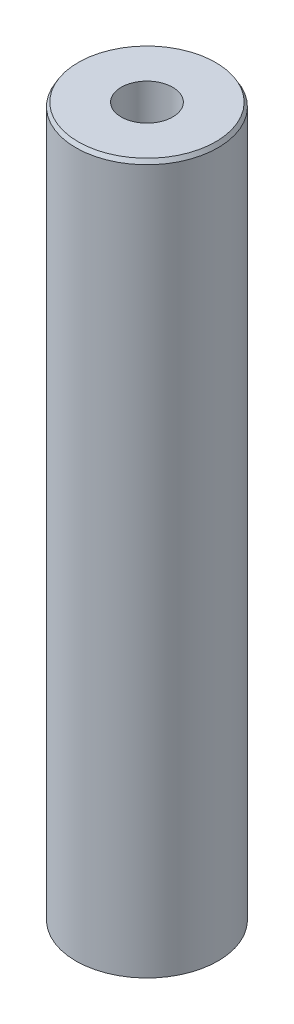
ISO-10303-21;
HEADER;
FILE_DESCRIPTION(('STEP AP214'),'2;1');
FILE_NAME('part.step','',(''),(''),'','','');
FILE_SCHEMA(('AUTOMOTIVE_DESIGN { 1 0 10303 214 1 1 1 1 }'));
ENDSEC;
DATA;
#1=APPLICATION_CONTEXT('core data for automotive mechanical design processes');
#2=APPLICATION_PROTOCOL_DEFINITION('international standard','automotive_design',2000,#1);
#3=PRODUCT_CONTEXT('',#1,'mechanical');
#4=PRODUCT('Part','Part','',(#3));
#5=PRODUCT_RELATED_PRODUCT_CATEGORY('part','',(#4));
#6=PRODUCT_DEFINITION_FORMATION('','',#4);
#7=PRODUCT_DEFINITION_CONTEXT('part definition',#1,'design');
#8=PRODUCT_DEFINITION('design','',#6,#7);
#9=PRODUCT_DEFINITION_SHAPE('','',#8);
#10=(LENGTH_UNIT() NAMED_UNIT(*) SI_UNIT(.MILLI.,.METRE.));
#11=(NAMED_UNIT(*) PLANE_ANGLE_UNIT() SI_UNIT($,.RADIAN.));
#12=(NAMED_UNIT(*) SI_UNIT($,.STERADIAN.) SOLID_ANGLE_UNIT());
#13=UNCERTAINTY_MEASURE_WITH_UNIT(LENGTH_MEASURE(1.E-05),#10,'distance_accuracy_value','');
#14=(GEOMETRIC_REPRESENTATION_CONTEXT(3) GLOBAL_UNCERTAINTY_ASSIGNED_CONTEXT((#13)) GLOBAL_UNIT_ASSIGNED_CONTEXT((#10,
#11,#12)) REPRESENTATION_CONTEXT('',''));
#15=CARTESIAN_POINT('',(0.,0.,0.));
#16=DIRECTION('',(0.,0.,1.));
#17=DIRECTION('',(1.,0.,0.));
#18=AXIS2_PLACEMENT_3D('',#15,#16,#17);
#19=CARTESIAN_POINT('',(0.,600.,0.));
#20=DIRECTION('',(0.,-1.,0.));
#21=DIRECTION('',(0.,0.,-1.));
#22=AXIS2_PLACEMENT_3D('',#19,#20,#21);
#23=CYLINDRICAL_SURFACE('',#22,60.);
#24=CARTESIAN_POINT('',(0.,596.612639440603,0.));
#25=DIRECTION('',(0.,1.,0.));
#26=DIRECTION('',(0.,0.,1.));
#27=AXIS2_PLACEMENT_3D('',#24,#25,#26);
#28=CIRCLE('',#27,60.);
#29=CARTESIAN_POINT('',(0.,596.612639440603,60.));
#30=VERTEX_POINT('',#29);
#31=EDGE_CURVE('E50',#30,#30,#28,.F.);
#32=ORIENTED_EDGE('',*,*,#31,.T.);
#33=EDGE_LOOP('',(#32));
#34=FACE_BOUND('',#33,.T.);
#35=CARTESIAN_POINT('',(0.,1.95569353081004,0.));
#36=DIRECTION('',(0.,1.,0.));
#37=DIRECTION('',(0.,0.,1.));
#38=AXIS2_PLACEMENT_3D('',#35,#36,#37);
#39=CIRCLE('',#38,60.);
#40=CARTESIAN_POINT('',(0.,1.95569353081004,60.));
#41=VERTEX_POINT('',#40);
#42=EDGE_CURVE('E51',#41,#41,#39,.T.);
#43=ORIENTED_EDGE('',*,*,#42,.T.);
#44=EDGE_LOOP('',(#43));
#45=FACE_BOUND('',#44,.T.);
#46=ADVANCED_FACE('F39',(#34,#45),#23,.T.);
#47=CARTESIAN_POINT('',(0.,600.,0.));
#48=DIRECTION('',(0.,1.,0.));
#49=DIRECTION('',(0.,0.,1.));
#50=AXIS2_PLACEMENT_3D('',#47,#48,#49);
#51=PLANE('',#50);
#52=CARTESIAN_POINT('',(0.,600.,0.));
#53=DIRECTION('',(0.,1.,0.));
#54=DIRECTION('',(0.,0.,1.));
#55=AXIS2_PLACEMENT_3D('',#52,#53,#54);
#56=CIRCLE('',#55,58.0443064691897);
#57=CARTESIAN_POINT('',(0.,600.,58.0443064691897));
#58=VERTEX_POINT('',#57);
#59=EDGE_CURVE('E54',#58,#58,#56,.T.);
#60=ORIENTED_EDGE('',*,*,#59,.T.);
#61=EDGE_LOOP('',(#60));
#62=FACE_BOUND('',#61,.T.);
#63=CARTESIAN_POINT('',(0.,600.,0.));
#64=DIRECTION('',(0.,1.,0.));
#65=DIRECTION('',(0.,0.,1.));
#66=AXIS2_PLACEMENT_3D('',#63,#64,#65);
#67=CIRCLE('',#66,21.758261297302);
#68=CARTESIAN_POINT('',(0.,600.,21.758261297302));
#69=VERTEX_POINT('',#68);
#70=EDGE_CURVE('E58',#69,#69,#67,.T.);
#71=ORIENTED_EDGE('',*,*,#70,.F.);
#72=EDGE_LOOP('',(#71));
#73=FACE_BOUND('',#72,.T.);
#74=ADVANCED_FACE('F69',(#62,#73),#51,.T.);
#75=CARTESIAN_POINT('',(0.,0.,0.));
#76=DIRECTION('',(0.,1.,0.));
#77=DIRECTION('',(0.,0.,1.));
#78=AXIS2_PLACEMENT_3D('',#75,#76,#77);
#79=PLANE('',#78);
#80=CARTESIAN_POINT('',(0.,0.,0.));
#81=DIRECTION('',(0.,1.,0.));
#82=DIRECTION('',(0.,0.,1.));
#83=AXIS2_PLACEMENT_3D('',#80,#81,#82);
#84=CIRCLE('',#83,56.6126394406032);
#85=CARTESIAN_POINT('',(0.,0.,56.6126394406032));
#86=VERTEX_POINT('',#85);
#87=EDGE_CURVE('E10',#86,#86,#84,.F.);
#88=ORIENTED_EDGE('',*,*,#87,.T.);
#89=EDGE_LOOP('',(#88));
#90=FACE_BOUND('',#89,.T.);
#91=CARTESIAN_POINT('',(0.,0.,0.));
#92=DIRECTION('',(0.,1.,0.));
#93=DIRECTION('',(0.,0.,1.));
#94=AXIS2_PLACEMENT_3D('',#91,#92,#93);
#95=CIRCLE('',#94,21.758261297302);
#96=CARTESIAN_POINT('',(0.,0.,21.758261297302));
#97=VERTEX_POINT('',#96);
#98=EDGE_CURVE('E63',#97,#97,#95,.T.);
#99=ORIENTED_EDGE('',*,*,#98,.T.);
#100=EDGE_LOOP('',(#99));
#101=FACE_BOUND('',#100,.T.);
#102=ADVANCED_FACE('F75',(#90,#101),#79,.F.);
#103=CARTESIAN_POINT('',(0.,600.,0.));
#104=DIRECTION('',(0.,-1.,0.));
#105=DIRECTION('',(0.,0.,-1.));
#106=AXIS2_PLACEMENT_3D('',#103,#104,#105);
#107=CYLINDRICAL_SURFACE('',#106,21.758261297302);
#108=ORIENTED_EDGE('',*,*,#70,.T.);
#109=EDGE_LOOP('',(#108));
#110=FACE_BOUND('',#109,.T.);
#111=ORIENTED_EDGE('',*,*,#98,.F.);
#112=EDGE_LOOP('',(#111));
#113=FACE_BOUND('',#112,.T.);
#114=ADVANCED_FACE('F70',(#110,#113),#107,.F.);
#115=CARTESIAN_POINT('',(0.,600.,0.));
#116=DIRECTION('',(0.,-1.,0.));
#117=DIRECTION('',(0.,0.,-1.));
#118=AXIS2_PLACEMENT_3D('',#115,#116,#117);
#119=CONICAL_SURFACE('',#118,58.0443064691897,0.523598775598312);
#120=ORIENTED_EDGE('',*,*,#31,.F.);
#121=EDGE_LOOP('',(#120));
#122=FACE_BOUND('',#121,.T.);
#123=ORIENTED_EDGE('',*,*,#59,.F.);
#124=EDGE_LOOP('',(#123));
#125=FACE_BOUND('',#124,.T.);
#126=ADVANCED_FACE('F81',(#122,#125),#119,.T.);
#127=CARTESIAN_POINT('',(0.,1.95569353081004,0.));
#128=DIRECTION('',(0.,1.,0.));
#129=DIRECTION('',(0.,0.,1.));
#130=AXIS2_PLACEMENT_3D('',#127,#128,#129);
#131=CONICAL_SURFACE('',#130,60.,1.0471975511966);
#132=ORIENTED_EDGE('',*,*,#87,.F.);
#133=EDGE_LOOP('',(#132));
#134=FACE_BOUND('',#133,.T.);
#135=ORIENTED_EDGE('',*,*,#42,.F.);
#136=EDGE_LOOP('',(#135));
#137=FACE_BOUND('',#136,.T.);
#138=ADVANCED_FACE('F45',(#134,#137),#131,.T.);
#139=CLOSED_SHELL('',(#46,#74,#102,#114,#126,#138));
#140=MANIFOLD_SOLID_BREP('B2',#139);
#141=ADVANCED_BREP_SHAPE_REPRESENTATION('',(#18,#140),#14);
#142=SHAPE_DEFINITION_REPRESENTATION(#9,#141);
ENDSEC;
END-ISO-10303-21;
